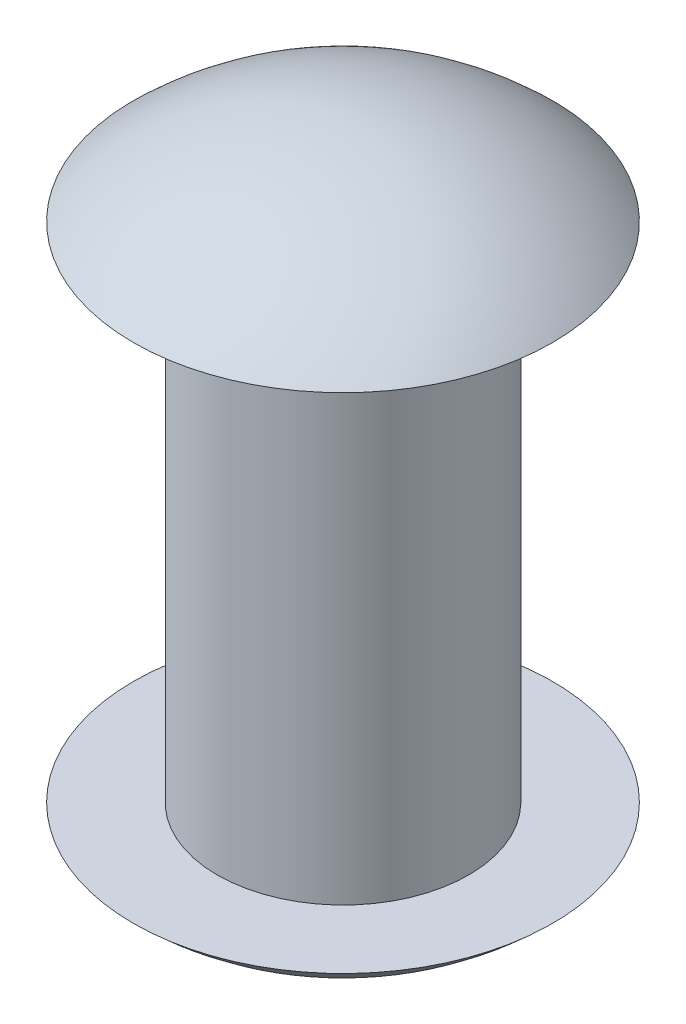
ISO-10303-21;
HEADER;
FILE_DESCRIPTION(('STEP AP214'),'2;1');
FILE_NAME('part.step','',(''),(''),'','','');
FILE_SCHEMA(('AUTOMOTIVE_DESIGN { 1 0 10303 214 1 1 1 1 }'));
ENDSEC;
DATA;
#1=APPLICATION_CONTEXT('core data for automotive mechanical design processes');
#2=APPLICATION_PROTOCOL_DEFINITION('international standard','automotive_design',2000,#1);
#3=PRODUCT_CONTEXT('',#1,'mechanical');
#4=PRODUCT('Part','Part','',(#3));
#5=PRODUCT_RELATED_PRODUCT_CATEGORY('part','',(#4));
#6=PRODUCT_DEFINITION_FORMATION('','',#4);
#7=PRODUCT_DEFINITION_CONTEXT('part definition',#1,'design');
#8=PRODUCT_DEFINITION('design','',#6,#7);
#9=PRODUCT_DEFINITION_SHAPE('','',#8);
#10=(LENGTH_UNIT() NAMED_UNIT(*) SI_UNIT(.MILLI.,.METRE.));
#11=(NAMED_UNIT(*) PLANE_ANGLE_UNIT() SI_UNIT($,.RADIAN.));
#12=(NAMED_UNIT(*) SI_UNIT($,.STERADIAN.) SOLID_ANGLE_UNIT());
#13=UNCERTAINTY_MEASURE_WITH_UNIT(LENGTH_MEASURE(1.E-05),#10,'distance_accuracy_value','');
#14=(GEOMETRIC_REPRESENTATION_CONTEXT(3) GLOBAL_UNCERTAINTY_ASSIGNED_CONTEXT((#13)) GLOBAL_UNIT_ASSIGNED_CONTEXT((#10,
#11,#12)) REPRESENTATION_CONTEXT('',''));
#15=CARTESIAN_POINT('',(0.,0.,0.));
#16=DIRECTION('',(0.,0.,1.));
#17=DIRECTION('',(1.,0.,0.));
#18=AXIS2_PLACEMENT_3D('',#15,#16,#17);
#19=CARTESIAN_POINT('',(0.,-3.75000000000001,0.));
#20=DIRECTION('',(0.,1.,0.));
#21=DIRECTION('',(-1.,0.,0.));
#22=AXIS2_PLACEMENT_3D('',#19,#20,#21);
#23=SPHERICAL_SURFACE('',#22,36.25);
#24=CARTESIAN_POINT('',(0.,-30.,0.));
#25=DIRECTION('',(0.,1.,0.));
#26=DIRECTION('',(0.,0.,1.));
#27=AXIS2_PLACEMENT_3D('',#24,#25,#26);
#28=CIRCLE('',#27,25.);
#29=CARTESIAN_POINT('',(0.,-30.,25.));
#30=VERTEX_POINT('',#29);
#31=EDGE_CURVE('E47',#30,#30,#28,.T.);
#32=ORIENTED_EDGE('',*,*,#31,.F.);
#33=EDGE_LOOP('',(#32));
#34=FACE_BOUND('',#33,.T.);
#35=ADVANCED_FACE('F33',(#34),#23,.T.);
#36=CARTESIAN_POINT('',(0.,3.75000000000001,0.));
#37=DIRECTION('',(0.,1.,0.));
#38=DIRECTION('',(1.,0.,0.));
#39=AXIS2_PLACEMENT_3D('',#36,#37,#38);
#40=SPHERICAL_SURFACE('',#39,36.25);
#41=CARTESIAN_POINT('',(0.,30.,0.));
#42=DIRECTION('',(0.,1.,0.));
#43=DIRECTION('',(0.,0.,1.));
#44=AXIS2_PLACEMENT_3D('',#41,#42,#43);
#45=CIRCLE('',#44,25.);
#46=CARTESIAN_POINT('',(0.,30.,25.));
#47=VERTEX_POINT('',#46);
#48=EDGE_CURVE('E10',#47,#47,#45,.T.);
#49=ORIENTED_EDGE('',*,*,#48,.T.);
#50=EDGE_LOOP('',(#49));
#51=FACE_BOUND('',#50,.T.);
#52=ADVANCED_FACE('F56',(#51),#40,.T.);
#53=CARTESIAN_POINT('',(15.,30.,0.));
#54=DIRECTION('',(0.,1.,0.));
#55=DIRECTION('',(0.,0.,1.));
#56=AXIS2_PLACEMENT_3D('',#53,#54,#55);
#57=PLANE('',#56);
#58=ORIENTED_EDGE('',*,*,#48,.F.);
#59=EDGE_LOOP('',(#58));
#60=FACE_BOUND('',#59,.T.);
#61=CARTESIAN_POINT('',(0.,30.,0.));
#62=DIRECTION('',(0.,1.,0.));
#63=DIRECTION('',(0.,0.,1.));
#64=AXIS2_PLACEMENT_3D('',#61,#62,#63);
#65=CIRCLE('',#64,15.);
#66=CARTESIAN_POINT('',(0.,30.,15.));
#67=VERTEX_POINT('',#66);
#68=EDGE_CURVE('E39',#67,#67,#65,.T.);
#69=ORIENTED_EDGE('',*,*,#68,.T.);
#70=EDGE_LOOP('',(#69));
#71=FACE_BOUND('',#70,.T.);
#72=ADVANCED_FACE('F60',(#60,#71),#57,.F.);
#73=CARTESIAN_POINT('',(0.,79.672131147541,0.));
#74=DIRECTION('',(0.,1.,0.));
#75=DIRECTION('',(0.,0.,1.));
#76=AXIS2_PLACEMENT_3D('',#73,#74,#75);
#77=CYLINDRICAL_SURFACE('',#76,15.);
#78=ORIENTED_EDGE('',*,*,#68,.F.);
#79=EDGE_LOOP('',(#78));
#80=FACE_BOUND('',#79,.T.);
#81=CARTESIAN_POINT('',(0.,-30.,0.));
#82=DIRECTION('',(0.,1.,0.));
#83=DIRECTION('',(0.,0.,1.));
#84=AXIS2_PLACEMENT_3D('',#81,#82,#83);
#85=CIRCLE('',#84,15.);
#86=CARTESIAN_POINT('',(0.,-30.,15.));
#87=VERTEX_POINT('',#86);
#88=EDGE_CURVE('E43',#87,#87,#85,.T.);
#89=ORIENTED_EDGE('',*,*,#88,.T.);
#90=EDGE_LOOP('',(#89));
#91=FACE_BOUND('',#90,.T.);
#92=ADVANCED_FACE('F64',(#80,#91),#77,.T.);
#93=CARTESIAN_POINT('',(15.,-30.,0.));
#94=DIRECTION('',(0.,-1.,0.));
#95=DIRECTION('',(0.,0.,-1.));
#96=AXIS2_PLACEMENT_3D('',#93,#94,#95);
#97=PLANE('',#96);
#98=ORIENTED_EDGE('',*,*,#88,.F.);
#99=EDGE_LOOP('',(#98));
#100=FACE_BOUND('',#99,.T.);
#101=ORIENTED_EDGE('',*,*,#31,.T.);
#102=EDGE_LOOP('',(#101));
#103=FACE_BOUND('',#102,.T.);
#104=ADVANCED_FACE('F53',(#100,#103),#97,.F.);
#105=CLOSED_SHELL('',(#35,#52,#72,#92,#104));
#106=MANIFOLD_SOLID_BREP('B2',#105);
#107=ADVANCED_BREP_SHAPE_REPRESENTATION('',(#18,#106),#14);
#108=SHAPE_DEFINITION_REPRESENTATION(#9,#107);
ENDSEC;
END-ISO-10303-21;
